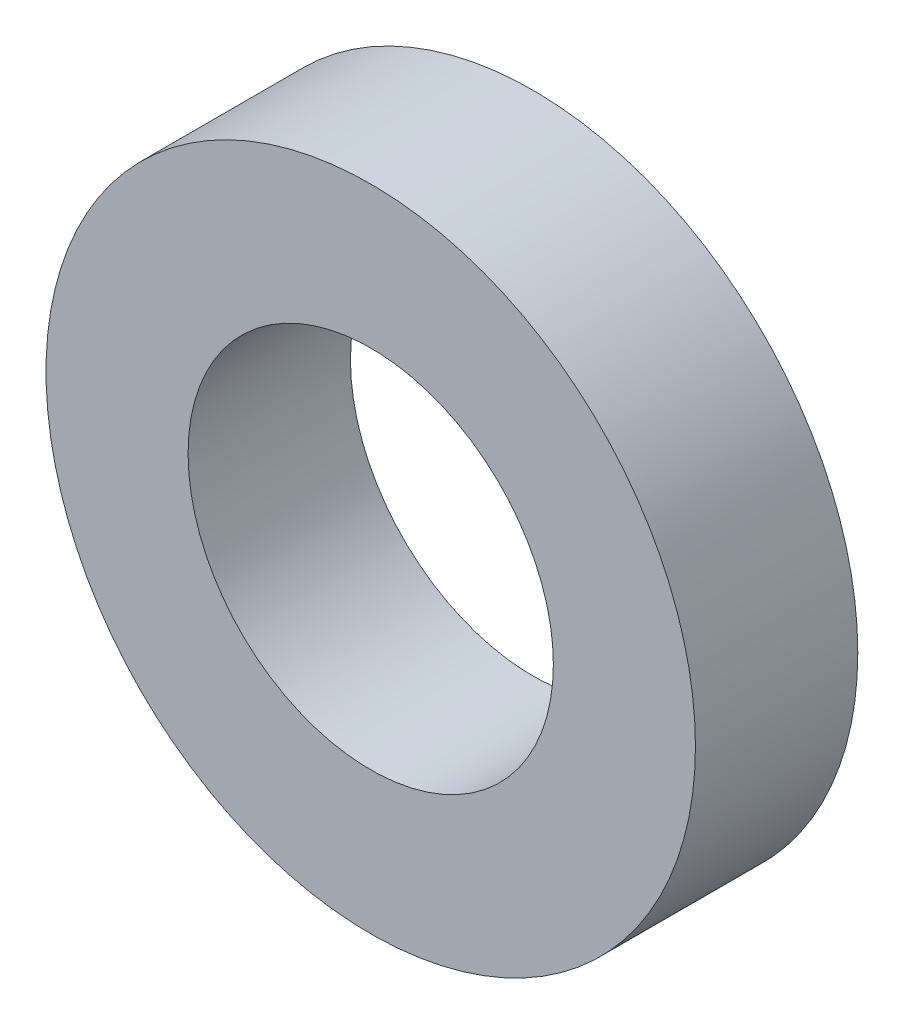
ISO-10303-21;
HEADER;
FILE_DESCRIPTION(('STEP AP214'),'2;1');
FILE_NAME('part.step','',(''),(''),'','','');
FILE_SCHEMA(('AUTOMOTIVE_DESIGN { 1 0 10303 214 1 1 1 1 }'));
ENDSEC;
DATA;
#1=APPLICATION_CONTEXT('core data for automotive mechanical design processes');
#2=APPLICATION_PROTOCOL_DEFINITION('international standard','automotive_design',2000,#1);
#3=PRODUCT_CONTEXT('',#1,'mechanical');
#4=PRODUCT('Part','Part','',(#3));
#5=PRODUCT_RELATED_PRODUCT_CATEGORY('part','',(#4));
#6=PRODUCT_DEFINITION_FORMATION('','',#4);
#7=PRODUCT_DEFINITION_CONTEXT('part definition',#1,'design');
#8=PRODUCT_DEFINITION('design','',#6,#7);
#9=PRODUCT_DEFINITION_SHAPE('','',#8);
#10=(LENGTH_UNIT() NAMED_UNIT(*) SI_UNIT(.MILLI.,.METRE.));
#11=(NAMED_UNIT(*) PLANE_ANGLE_UNIT() SI_UNIT($,.RADIAN.));
#12=(NAMED_UNIT(*) SI_UNIT($,.STERADIAN.) SOLID_ANGLE_UNIT());
#13=UNCERTAINTY_MEASURE_WITH_UNIT(LENGTH_MEASURE(1.E-05),#10,'distance_accuracy_value','');
#14=(GEOMETRIC_REPRESENTATION_CONTEXT(3) GLOBAL_UNCERTAINTY_ASSIGNED_CONTEXT((#13)) GLOBAL_UNIT_ASSIGNED_CONTEXT((#10,
#11,#12)) REPRESENTATION_CONTEXT('',''));
#15=CARTESIAN_POINT('',(0.,0.,0.));
#16=DIRECTION('',(0.,0.,1.));
#17=DIRECTION('',(1.,0.,0.));
#18=AXIS2_PLACEMENT_3D('',#15,#16,#17);
#19=CARTESIAN_POINT('',(0.,0.,2.));
#20=DIRECTION('',(0.,0.,1.));
#21=DIRECTION('',(1.,0.,0.));
#22=AXIS2_PLACEMENT_3D('',#19,#20,#21);
#23=PLANE('',#22);
#24=CARTESIAN_POINT('',(0.,0.,2.));
#25=DIRECTION('',(0.,0.,1.));
#26=DIRECTION('',(1.,0.,0.));
#27=AXIS2_PLACEMENT_3D('',#24,#25,#26);
#28=CIRCLE('',#27,4.);
#29=CARTESIAN_POINT('',(4.,0.,2.));
#30=VERTEX_POINT('',#29);
#31=EDGE_CURVE('E10',#30,#30,#28,.T.);
#32=ORIENTED_EDGE('',*,*,#31,.T.);
#33=EDGE_LOOP('',(#32));
#34=FACE_BOUND('',#33,.T.);
#35=CARTESIAN_POINT('',(0.,0.,2.));
#36=DIRECTION('',(0.,0.,1.));
#37=DIRECTION('',(1.,0.,0.));
#38=AXIS2_PLACEMENT_3D('',#35,#36,#37);
#39=CIRCLE('',#38,2.25);
#40=CARTESIAN_POINT('',(2.25,0.,2.));
#41=VERTEX_POINT('',#40);
#42=EDGE_CURVE('E50',#41,#41,#39,.T.);
#43=ORIENTED_EDGE('',*,*,#42,.F.);
#44=EDGE_LOOP('',(#43));
#45=FACE_BOUND('',#44,.T.);
#46=ADVANCED_FACE('F37',(#34,#45),#23,.T.);
#47=CARTESIAN_POINT('',(0.,0.,0.));
#48=DIRECTION('',(0.,0.,1.));
#49=DIRECTION('',(1.,0.,0.));
#50=AXIS2_PLACEMENT_3D('',#47,#48,#49);
#51=PLANE('',#50);
#52=CARTESIAN_POINT('',(0.,0.,0.));
#53=DIRECTION('',(0.,0.,1.));
#54=DIRECTION('',(1.,0.,0.));
#55=AXIS2_PLACEMENT_3D('',#52,#53,#54);
#56=CIRCLE('',#55,4.);
#57=CARTESIAN_POINT('',(4.,0.,0.));
#58=VERTEX_POINT('',#57);
#59=EDGE_CURVE('E41',#58,#58,#56,.T.);
#60=ORIENTED_EDGE('',*,*,#59,.F.);
#61=EDGE_LOOP('',(#60));
#62=FACE_BOUND('',#61,.T.);
#63=CARTESIAN_POINT('',(0.,0.,0.));
#64=DIRECTION('',(0.,0.,1.));
#65=DIRECTION('',(1.,0.,0.));
#66=AXIS2_PLACEMENT_3D('',#63,#64,#65);
#67=CIRCLE('',#66,2.25);
#68=CARTESIAN_POINT('',(2.25,0.,0.));
#69=VERTEX_POINT('',#68);
#70=EDGE_CURVE('E52',#69,#69,#67,.T.);
#71=ORIENTED_EDGE('',*,*,#70,.T.);
#72=EDGE_LOOP('',(#71));
#73=FACE_BOUND('',#72,.T.);
#74=ADVANCED_FACE('F64',(#62,#73),#51,.F.);
#75=CARTESIAN_POINT('',(0.,0.,2.));
#76=DIRECTION('',(0.,0.,-1.));
#77=DIRECTION('',(-1.,0.,0.));
#78=AXIS2_PLACEMENT_3D('',#75,#76,#77);
#79=CYLINDRICAL_SURFACE('',#78,4.);
#80=ORIENTED_EDGE('',*,*,#31,.F.);
#81=EDGE_LOOP('',(#80));
#82=FACE_BOUND('',#81,.T.);
#83=ORIENTED_EDGE('',*,*,#59,.T.);
#84=EDGE_LOOP('',(#83));
#85=FACE_BOUND('',#84,.T.);
#86=ADVANCED_FACE('F39',(#82,#85),#79,.T.);
#87=CARTESIAN_POINT('',(0.,0.,2.));
#88=DIRECTION('',(0.,0.,-1.));
#89=DIRECTION('',(-1.,0.,0.));
#90=AXIS2_PLACEMENT_3D('',#87,#88,#89);
#91=CYLINDRICAL_SURFACE('',#90,2.25);
#92=ORIENTED_EDGE('',*,*,#42,.T.);
#93=EDGE_LOOP('',(#92));
#94=FACE_BOUND('',#93,.T.);
#95=ORIENTED_EDGE('',*,*,#70,.F.);
#96=EDGE_LOOP('',(#95));
#97=FACE_BOUND('',#96,.T.);
#98=ADVANCED_FACE('F60',(#94,#97),#91,.F.);
#99=CLOSED_SHELL('',(#46,#74,#86,#98));
#100=MANIFOLD_SOLID_BREP('B2',#99);
#101=ADVANCED_BREP_SHAPE_REPRESENTATION('',(#18,#100),#14);
#102=SHAPE_DEFINITION_REPRESENTATION(#9,#101);
ENDSEC;
END-ISO-10303-21;
